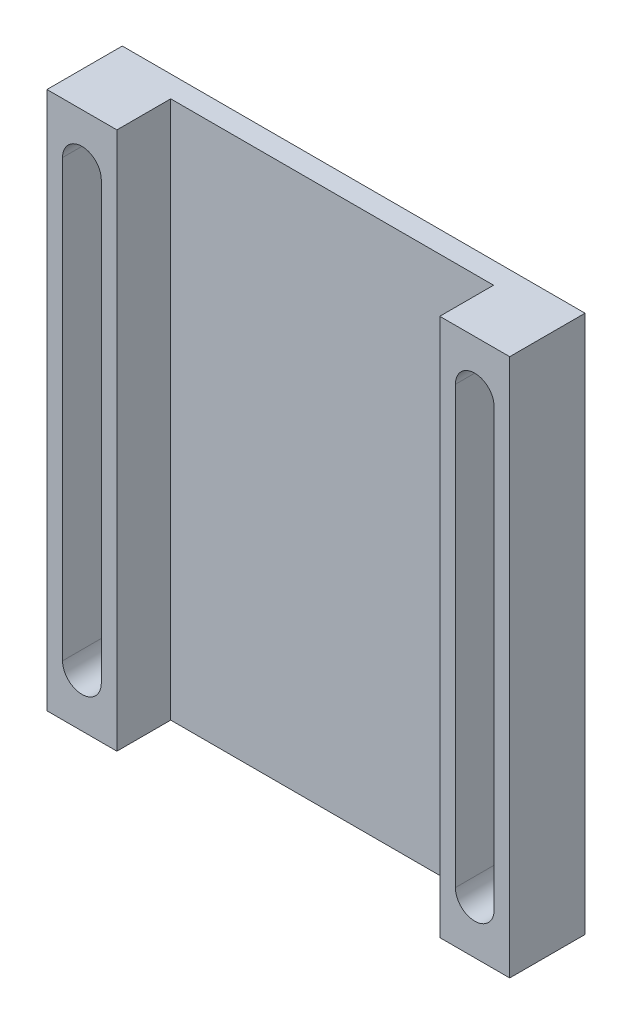
ISO-10303-21;
HEADER;
FILE_DESCRIPTION(('STEP AP214'),'2;1');
FILE_NAME('part.step','',(''),(''),'','','');
FILE_SCHEMA(('AUTOMOTIVE_DESIGN { 1 0 10303 214 1 1 1 1 }'));
ENDSEC;
DATA;
#1=APPLICATION_CONTEXT('core data for automotive mechanical design processes');
#2=APPLICATION_PROTOCOL_DEFINITION('international standard','automotive_design',2000,#1);
#3=PRODUCT_CONTEXT('',#1,'mechanical');
#4=PRODUCT('Part','Part','',(#3));
#5=PRODUCT_RELATED_PRODUCT_CATEGORY('part','',(#4));
#6=PRODUCT_DEFINITION_FORMATION('','',#4);
#7=PRODUCT_DEFINITION_CONTEXT('part definition',#1,'design');
#8=PRODUCT_DEFINITION('design','',#6,#7);
#9=PRODUCT_DEFINITION_SHAPE('','',#8);
#10=(LENGTH_UNIT() NAMED_UNIT(*) SI_UNIT(.MILLI.,.METRE.));
#11=(NAMED_UNIT(*) PLANE_ANGLE_UNIT() SI_UNIT($,.RADIAN.));
#12=(NAMED_UNIT(*) SI_UNIT($,.STERADIAN.) SOLID_ANGLE_UNIT());
#13=UNCERTAINTY_MEASURE_WITH_UNIT(LENGTH_MEASURE(1.E-05),#10,'distance_accuracy_value','');
#14=(GEOMETRIC_REPRESENTATION_CONTEXT(3) GLOBAL_UNCERTAINTY_ASSIGNED_CONTEXT((#13)) GLOBAL_UNIT_ASSIGNED_CONTEXT((#10,
#11,#12)) REPRESENTATION_CONTEXT('',''));
#15=CARTESIAN_POINT('',(0.,0.,0.));
#16=DIRECTION('',(0.,0.,1.));
#17=DIRECTION('',(1.,0.,0.));
#18=AXIS2_PLACEMENT_3D('',#15,#16,#17);
#19=CARTESIAN_POINT('',(0.,0.,70.));
#20=DIRECTION('',(0.,0.,1.));
#21=DIRECTION('',(1.,0.,0.));
#22=AXIS2_PLACEMENT_3D('',#19,#20,#21);
#23=PLANE('',#22);
#24=DIRECTION('',(1.,0.,0.));
#25=VECTOR('',#24,1.);
#26=CARTESIAN_POINT('',(0.,250.,70.));
#27=LINE('',#26,#25);
#28=CARTESIAN_POINT('',(150.,250.,70.));
#29=VERTEX_POINT('',#28);
#30=CARTESIAN_POINT('',(215.,250.,70.));
#31=VERTEX_POINT('',#30);
#32=EDGE_CURVE('E271',#29,#31,#27,.T.);
#33=ORIENTED_EDGE('',*,*,#32,.F.);
#34=DIRECTION('',(0.,-1.,0.));
#35=VECTOR('',#34,1.);
#36=CARTESIAN_POINT('',(150.,0.,70.));
#37=LINE('',#36,#35);
#38=CARTESIAN_POINT('',(150.,-250.,70.));
#39=VERTEX_POINT('',#38);
#40=EDGE_CURVE('E274',#29,#39,#37,.T.);
#41=ORIENTED_EDGE('',*,*,#40,.T.);
#42=DIRECTION('',(1.,0.,0.));
#43=VECTOR('',#42,1.);
#44=CARTESIAN_POINT('',(0.,-250.,70.));
#45=LINE('',#44,#43);
#46=CARTESIAN_POINT('',(215.,-250.,70.));
#47=VERTEX_POINT('',#46);
#48=EDGE_CURVE('E276',#39,#47,#45,.T.);
#49=ORIENTED_EDGE('',*,*,#48,.T.);
#50=DIRECTION('',(0.,-1.,0.));
#51=VECTOR('',#50,1.);
#52=CARTESIAN_POINT('',(215.,0.,70.));
#53=LINE('',#52,#51);
#54=EDGE_CURVE('E278',#31,#47,#53,.T.);
#55=ORIENTED_EDGE('',*,*,#54,.F.);
#56=EDGE_LOOP('',(#33,#41,#49,#55));
#57=FACE_BOUND('',#56,.T.);
#58=CARTESIAN_POINT('',(182.5,-202.5,70.));
#59=DIRECTION('',(0.,0.,1.));
#60=DIRECTION('',(1.,0.,0.));
#61=AXIS2_PLACEMENT_3D('',#58,#59,#60);
#62=CIRCLE('',#61,18.);
#63=CARTESIAN_POINT('',(164.5,-202.5,70.));
#64=VERTEX_POINT('',#63);
#65=CARTESIAN_POINT('',(200.5,-202.5,70.));
#66=VERTEX_POINT('',#65);
#67=EDGE_CURVE('E226',#64,#66,#62,.T.);
#68=ORIENTED_EDGE('',*,*,#67,.F.);
#69=DIRECTION('',(0.,1.,0.));
#70=VECTOR('',#69,1.);
#71=CARTESIAN_POINT('',(164.5,0.,70.));
#72=LINE('',#71,#70);
#73=CARTESIAN_POINT('',(164.5,202.5,70.));
#74=VERTEX_POINT('',#73);
#75=EDGE_CURVE('E81',#64,#74,#72,.T.);
#76=ORIENTED_EDGE('',*,*,#75,.T.);
#77=CARTESIAN_POINT('',(182.5,202.5,70.));
#78=DIRECTION('',(0.,0.,1.));
#79=DIRECTION('',(1.,0.,0.));
#80=AXIS2_PLACEMENT_3D('',#77,#78,#79);
#81=CIRCLE('',#80,18.);
#82=CARTESIAN_POINT('',(200.5,202.5,70.));
#83=VERTEX_POINT('',#82);
#84=EDGE_CURVE('E233',#83,#74,#81,.T.);
#85=ORIENTED_EDGE('',*,*,#84,.F.);
#86=DIRECTION('',(0.,1.,0.));
#87=VECTOR('',#86,1.);
#88=CARTESIAN_POINT('',(200.5,0.,70.));
#89=LINE('',#88,#87);
#90=EDGE_CURVE('E229',#66,#83,#89,.T.);
#91=ORIENTED_EDGE('',*,*,#90,.F.);
#92=EDGE_LOOP('',(#68,#76,#85,#91));
#93=FACE_BOUND('',#92,.T.);
#94=ADVANCED_FACE('F64',(#57,#93),#23,.T.);
#95=CARTESIAN_POINT('',(0.,250.,20.));
#96=DIRECTION('',(0.,1.,0.));
#97=DIRECTION('',(0.,0.,1.));
#98=AXIS2_PLACEMENT_3D('',#95,#96,#97);
#99=PLANE('',#98);
#100=DIRECTION('',(1.,0.,0.));
#101=VECTOR('',#100,1.);
#102=CARTESIAN_POINT('',(0.,250.,0.));
#103=LINE('',#102,#101);
#104=CARTESIAN_POINT('',(-215.,250.,0.));
#105=VERTEX_POINT('',#104);
#106=CARTESIAN_POINT('',(215.,250.,0.));
#107=VERTEX_POINT('',#106);
#108=EDGE_CURVE('E295',#105,#107,#103,.T.);
#109=ORIENTED_EDGE('',*,*,#108,.F.);
#110=DIRECTION('',(0.,0.,-1.));
#111=VECTOR('',#110,1.);
#112=CARTESIAN_POINT('',(-215.,250.,70.));
#113=LINE('',#112,#111);
#114=CARTESIAN_POINT('',(-215.,250.,70.));
#115=VERTEX_POINT('',#114);
#116=EDGE_CURVE('E213',#115,#105,#113,.T.);
#117=ORIENTED_EDGE('',*,*,#116,.F.);
#118=DIRECTION('',(1.,0.,0.));
#119=VECTOR('',#118,1.);
#120=CARTESIAN_POINT('',(0.,250.,70.));
#121=LINE('',#120,#119);
#122=CARTESIAN_POINT('',(-150.,250.,70.));
#123=VERTEX_POINT('',#122);
#124=EDGE_CURVE('E261',#115,#123,#121,.T.);
#125=ORIENTED_EDGE('',*,*,#124,.T.);
#126=DIRECTION('',(0.,0.,-1.));
#127=VECTOR('',#126,1.);
#128=CARTESIAN_POINT('',(-150.,250.,70.));
#129=LINE('',#128,#127);
#130=CARTESIAN_POINT('',(-150.,250.,20.));
#131=VERTEX_POINT('',#130);
#132=EDGE_CURVE('E253',#123,#131,#129,.T.);
#133=ORIENTED_EDGE('',*,*,#132,.T.);
#134=DIRECTION('',(1.,0.,0.));
#135=VECTOR('',#134,1.);
#136=CARTESIAN_POINT('',(0.,250.,20.));
#137=LINE('',#136,#135);
#138=CARTESIAN_POINT('',(150.,250.,20.));
#139=VERTEX_POINT('',#138);
#140=EDGE_CURVE('E296',#131,#139,#137,.T.);
#141=ORIENTED_EDGE('',*,*,#140,.T.);
#142=DIRECTION('',(0.,0.,-1.));
#143=VECTOR('',#142,1.);
#144=CARTESIAN_POINT('',(150.,250.,70.));
#145=LINE('',#144,#143);
#146=EDGE_CURVE('E292',#29,#139,#145,.T.);
#147=ORIENTED_EDGE('',*,*,#146,.F.);
#148=ORIENTED_EDGE('',*,*,#32,.T.);
#149=DIRECTION('',(0.,0.,-1.));
#150=VECTOR('',#149,1.);
#151=CARTESIAN_POINT('',(215.,250.,70.));
#152=LINE('',#151,#150);
#153=EDGE_CURVE('E281',#31,#107,#152,.T.);
#154=ORIENTED_EDGE('',*,*,#153,.T.);
#155=EDGE_LOOP('',(#109,#117,#125,#133,#141,#147,#148,#154));
#156=FACE_BOUND('',#155,.T.);
#157=ADVANCED_FACE('F66',(#156),#99,.T.);
#158=CARTESIAN_POINT('',(0.,-250.,20.));
#159=DIRECTION('',(0.,1.,0.));
#160=DIRECTION('',(0.,0.,1.));
#161=AXIS2_PLACEMENT_3D('',#158,#159,#160);
#162=PLANE('',#161);
#163=DIRECTION('',(1.,0.,0.));
#164=VECTOR('',#163,1.);
#165=CARTESIAN_POINT('',(0.,-250.,0.));
#166=LINE('',#165,#164);
#167=CARTESIAN_POINT('',(-215.,-250.,0.));
#168=VERTEX_POINT('',#167);
#169=CARTESIAN_POINT('',(215.,-250.,0.));
#170=VERTEX_POINT('',#169);
#171=EDGE_CURVE('E68',#168,#170,#166,.T.);
#172=ORIENTED_EDGE('',*,*,#171,.T.);
#173=DIRECTION('',(0.,0.,-1.));
#174=VECTOR('',#173,1.);
#175=CARTESIAN_POINT('',(215.,-250.,70.));
#176=LINE('',#175,#174);
#177=EDGE_CURVE('E286',#47,#170,#176,.T.);
#178=ORIENTED_EDGE('',*,*,#177,.F.);
#179=ORIENTED_EDGE('',*,*,#48,.F.);
#180=DIRECTION('',(0.,0.,-1.));
#181=VECTOR('',#180,1.);
#182=CARTESIAN_POINT('',(150.,-250.,70.));
#183=LINE('',#182,#181);
#184=CARTESIAN_POINT('',(150.,-250.,20.));
#185=VERTEX_POINT('',#184);
#186=EDGE_CURVE('E289',#39,#185,#183,.T.);
#187=ORIENTED_EDGE('',*,*,#186,.T.);
#188=DIRECTION('',(1.,0.,0.));
#189=VECTOR('',#188,1.);
#190=CARTESIAN_POINT('',(0.,-250.,20.));
#191=LINE('',#190,#189);
#192=CARTESIAN_POINT('',(-150.,-250.,20.));
#193=VERTEX_POINT('',#192);
#194=EDGE_CURVE('E73',#193,#185,#191,.T.);
#195=ORIENTED_EDGE('',*,*,#194,.F.);
#196=DIRECTION('',(0.,0.,-1.));
#197=VECTOR('',#196,1.);
#198=CARTESIAN_POINT('',(-150.,-250.,70.));
#199=LINE('',#198,#197);
#200=CARTESIAN_POINT('',(-150.,-250.,70.));
#201=VERTEX_POINT('',#200);
#202=EDGE_CURVE('E251',#201,#193,#199,.T.);
#203=ORIENTED_EDGE('',*,*,#202,.F.);
#204=DIRECTION('',(1.,0.,0.));
#205=VECTOR('',#204,1.);
#206=CARTESIAN_POINT('',(0.,-250.,70.));
#207=LINE('',#206,#205);
#208=CARTESIAN_POINT('',(-215.,-250.,70.));
#209=VERTEX_POINT('',#208);
#210=EDGE_CURVE('E264',#209,#201,#207,.T.);
#211=ORIENTED_EDGE('',*,*,#210,.F.);
#212=DIRECTION('',(0.,0.,-1.));
#213=VECTOR('',#212,1.);
#214=CARTESIAN_POINT('',(-215.,-250.,70.));
#215=LINE('',#214,#213);
#216=EDGE_CURVE('E248',#209,#168,#215,.T.);
#217=ORIENTED_EDGE('',*,*,#216,.T.);
#218=EDGE_LOOP('',(#172,#178,#179,#187,#195,#203,#211,#217));
#219=FACE_BOUND('',#218,.T.);
#220=ADVANCED_FACE('F305',(#219),#162,.F.);
#221=CARTESIAN_POINT('',(0.,0.,20.));
#222=DIRECTION('',(0.,0.,1.));
#223=DIRECTION('',(1.,0.,0.));
#224=AXIS2_PLACEMENT_3D('',#221,#222,#223);
#225=PLANE('',#224);
#226=ORIENTED_EDGE('',*,*,#140,.F.);
#227=DIRECTION('',(0.,-1.,0.));
#228=VECTOR('',#227,1.);
#229=CARTESIAN_POINT('',(-150.,0.,20.));
#230=LINE('',#229,#228);
#231=EDGE_CURVE('E298',#131,#193,#230,.T.);
#232=ORIENTED_EDGE('',*,*,#231,.T.);
#233=ORIENTED_EDGE('',*,*,#194,.T.);
#234=DIRECTION('',(0.,-1.,0.));
#235=VECTOR('',#234,1.);
#236=CARTESIAN_POINT('',(150.,0.,20.));
#237=LINE('',#236,#235);
#238=EDGE_CURVE('E12',#139,#185,#237,.T.);
#239=ORIENTED_EDGE('',*,*,#238,.F.);
#240=EDGE_LOOP('',(#226,#232,#233,#239));
#241=FACE_BOUND('',#240,.T.);
#242=ADVANCED_FACE('F315',(#241),#225,.T.);
#243=CARTESIAN_POINT('',(0.,0.,0.));
#244=DIRECTION('',(0.,0.,1.));
#245=DIRECTION('',(1.,0.,0.));
#246=AXIS2_PLACEMENT_3D('',#243,#244,#245);
#247=PLANE('',#246);
#248=ORIENTED_EDGE('',*,*,#108,.T.);
#249=DIRECTION('',(0.,-1.,0.));
#250=VECTOR('',#249,1.);
#251=CARTESIAN_POINT('',(215.,0.,0.));
#252=LINE('',#251,#250);
#253=EDGE_CURVE('E260',#107,#170,#252,.T.);
#254=ORIENTED_EDGE('',*,*,#253,.T.);
#255=ORIENTED_EDGE('',*,*,#171,.F.);
#256=DIRECTION('',(0.,-1.,0.));
#257=VECTOR('',#256,1.);
#258=CARTESIAN_POINT('',(-215.,0.,0.));
#259=LINE('',#258,#257);
#260=EDGE_CURVE('E257',#105,#168,#259,.T.);
#261=ORIENTED_EDGE('',*,*,#260,.F.);
#262=EDGE_LOOP('',(#248,#254,#255,#261));
#263=FACE_BOUND('',#262,.T.);
#264=ADVANCED_FACE('F312',(#263),#247,.F.);
#265=CARTESIAN_POINT('',(150.,0.,70.));
#266=DIRECTION('',(1.,0.,0.));
#267=DIRECTION('',(0.,0.,-1.));
#268=AXIS2_PLACEMENT_3D('',#265,#266,#267);
#269=PLANE('',#268);
#270=ORIENTED_EDGE('',*,*,#146,.T.);
#271=ORIENTED_EDGE('',*,*,#238,.T.);
#272=ORIENTED_EDGE('',*,*,#186,.F.);
#273=ORIENTED_EDGE('',*,*,#40,.F.);
#274=EDGE_LOOP('',(#270,#271,#272,#273));
#275=FACE_BOUND('',#274,.T.);
#276=ADVANCED_FACE('F314',(#275),#269,.F.);
#277=CARTESIAN_POINT('',(215.,0.,70.));
#278=DIRECTION('',(1.,0.,0.));
#279=DIRECTION('',(0.,0.,-1.));
#280=AXIS2_PLACEMENT_3D('',#277,#278,#279);
#281=PLANE('',#280);
#282=ORIENTED_EDGE('',*,*,#253,.F.);
#283=ORIENTED_EDGE('',*,*,#153,.F.);
#284=ORIENTED_EDGE('',*,*,#54,.T.);
#285=ORIENTED_EDGE('',*,*,#177,.T.);
#286=EDGE_LOOP('',(#282,#283,#284,#285));
#287=FACE_BOUND('',#286,.T.);
#288=ADVANCED_FACE('F310',(#287),#281,.T.);
#289=CARTESIAN_POINT('',(-150.,0.,70.));
#290=DIRECTION('',(1.,0.,0.));
#291=DIRECTION('',(0.,0.,-1.));
#292=AXIS2_PLACEMENT_3D('',#289,#290,#291);
#293=PLANE('',#292);
#294=ORIENTED_EDGE('',*,*,#231,.F.);
#295=ORIENTED_EDGE('',*,*,#132,.F.);
#296=DIRECTION('',(0.,-1.,0.));
#297=VECTOR('',#296,1.);
#298=CARTESIAN_POINT('',(-150.,0.,70.));
#299=LINE('',#298,#297);
#300=EDGE_CURVE('E256',#123,#201,#299,.T.);
#301=ORIENTED_EDGE('',*,*,#300,.T.);
#302=ORIENTED_EDGE('',*,*,#202,.T.);
#303=EDGE_LOOP('',(#294,#295,#301,#302));
#304=FACE_BOUND('',#303,.T.);
#305=ADVANCED_FACE('F339',(#304),#293,.T.);
#306=CARTESIAN_POINT('',(-215.,0.,70.));
#307=DIRECTION('',(1.,0.,0.));
#308=DIRECTION('',(0.,0.,-1.));
#309=AXIS2_PLACEMENT_3D('',#306,#307,#308);
#310=PLANE('',#309);
#311=ORIENTED_EDGE('',*,*,#260,.T.);
#312=ORIENTED_EDGE('',*,*,#216,.F.);
#313=DIRECTION('',(0.,-1.,0.));
#314=VECTOR('',#313,1.);
#315=CARTESIAN_POINT('',(-215.,0.,70.));
#316=LINE('',#315,#314);
#317=EDGE_CURVE('E266',#115,#209,#316,.T.);
#318=ORIENTED_EDGE('',*,*,#317,.F.);
#319=ORIENTED_EDGE('',*,*,#116,.T.);
#320=EDGE_LOOP('',(#311,#312,#318,#319));
#321=FACE_BOUND('',#320,.T.);
#322=ADVANCED_FACE('F343',(#321),#310,.F.);
#323=CARTESIAN_POINT('',(0.,0.,70.));
#324=DIRECTION('',(0.,0.,1.));
#325=DIRECTION('',(1.,0.,0.));
#326=AXIS2_PLACEMENT_3D('',#323,#324,#325);
#327=PLANE('',#326);
#328=CARTESIAN_POINT('',(-182.5,-202.5,70.));
#329=DIRECTION('',(0.,0.,1.));
#330=DIRECTION('',(1.,0.,0.));
#331=AXIS2_PLACEMENT_3D('',#328,#329,#330);
#332=CIRCLE('',#331,18.);
#333=CARTESIAN_POINT('',(-200.5,-202.5,70.));
#334=VERTEX_POINT('',#333);
#335=CARTESIAN_POINT('',(-164.5,-202.5,70.));
#336=VERTEX_POINT('',#335);
#337=EDGE_CURVE('E89',#334,#336,#332,.T.);
#338=ORIENTED_EDGE('',*,*,#337,.F.);
#339=DIRECTION('',(0.,1.,0.));
#340=VECTOR('',#339,1.);
#341=CARTESIAN_POINT('',(-200.5,0.,70.));
#342=LINE('',#341,#340);
#343=CARTESIAN_POINT('',(-200.5,202.5,70.));
#344=VERTEX_POINT('',#343);
#345=EDGE_CURVE('E198',#334,#344,#342,.T.);
#346=ORIENTED_EDGE('',*,*,#345,.T.);
#347=CARTESIAN_POINT('',(-182.5,202.5,70.));
#348=DIRECTION('',(0.,0.,1.));
#349=DIRECTION('',(1.,0.,0.));
#350=AXIS2_PLACEMENT_3D('',#347,#348,#349);
#351=CIRCLE('',#350,18.);
#352=CARTESIAN_POINT('',(-164.5,202.5,70.));
#353=VERTEX_POINT('',#352);
#354=EDGE_CURVE('E201',#353,#344,#351,.T.);
#355=ORIENTED_EDGE('',*,*,#354,.F.);
#356=DIRECTION('',(0.,1.,0.));
#357=VECTOR('',#356,1.);
#358=CARTESIAN_POINT('',(-164.5,0.,70.));
#359=LINE('',#358,#357);
#360=EDGE_CURVE('E207',#336,#353,#359,.T.);
#361=ORIENTED_EDGE('',*,*,#360,.F.);
#362=EDGE_LOOP('',(#338,#346,#355,#361));
#363=FACE_BOUND('',#362,.T.);
#364=ORIENTED_EDGE('',*,*,#124,.F.);
#365=ORIENTED_EDGE('',*,*,#317,.T.);
#366=ORIENTED_EDGE('',*,*,#210,.T.);
#367=ORIENTED_EDGE('',*,*,#300,.F.);
#368=EDGE_LOOP('',(#364,#365,#366,#367));
#369=FACE_BOUND('',#368,.T.);
#370=ADVANCED_FACE('F336',(#363,#369),#327,.T.);
#371=CARTESIAN_POINT('',(-182.5,-202.5,23.));
#372=DIRECTION('',(0.,0.,1.));
#373=DIRECTION('',(1.,0.,0.));
#374=AXIS2_PLACEMENT_3D('',#371,#372,#373);
#375=CYLINDRICAL_SURFACE('',#374,18.);
#376=ORIENTED_EDGE('',*,*,#337,.T.);
#377=DIRECTION('',(0.,0.,1.));
#378=VECTOR('',#377,1.);
#379=CARTESIAN_POINT('',(-164.5,-202.5,23.));
#380=LINE('',#379,#378);
#381=CARTESIAN_POINT('',(-164.5,-202.5,23.));
#382=VERTEX_POINT('',#381);
#383=EDGE_CURVE('E177',#382,#336,#380,.T.);
#384=ORIENTED_EDGE('',*,*,#383,.F.);
#385=CARTESIAN_POINT('',(-182.5,-202.5,23.));
#386=DIRECTION('',(0.,0.,1.));
#387=DIRECTION('',(1.,0.,0.));
#388=AXIS2_PLACEMENT_3D('',#385,#386,#387);
#389=CIRCLE('',#388,18.);
#390=CARTESIAN_POINT('',(-200.5,-202.5,23.));
#391=VERTEX_POINT('',#390);
#392=EDGE_CURVE('E181',#391,#382,#389,.T.);
#393=ORIENTED_EDGE('',*,*,#392,.F.);
#394=DIRECTION('',(0.,0.,1.));
#395=VECTOR('',#394,1.);
#396=CARTESIAN_POINT('',(-200.5,-202.5,23.));
#397=LINE('',#396,#395);
#398=EDGE_CURVE('E211',#391,#334,#397,.T.);
#399=ORIENTED_EDGE('',*,*,#398,.T.);
#400=EDGE_LOOP('',(#376,#384,#393,#399));
#401=FACE_BOUND('',#400,.T.);
#402=ADVANCED_FACE('F179',(#401),#375,.F.);
#403=CARTESIAN_POINT('',(-200.5,0.,23.));
#404=DIRECTION('',(1.,0.,0.));
#405=DIRECTION('',(0.,0.,-1.));
#406=AXIS2_PLACEMENT_3D('',#403,#404,#405);
#407=PLANE('',#406);
#408=ORIENTED_EDGE('',*,*,#345,.F.);
#409=ORIENTED_EDGE('',*,*,#398,.F.);
#410=DIRECTION('',(0.,1.,0.));
#411=VECTOR('',#410,1.);
#412=CARTESIAN_POINT('',(-200.5,0.,23.));
#413=LINE('',#412,#411);
#414=CARTESIAN_POINT('',(-200.5,202.5,23.));
#415=VERTEX_POINT('',#414);
#416=EDGE_CURVE('E186',#391,#415,#413,.T.);
#417=ORIENTED_EDGE('',*,*,#416,.T.);
#418=DIRECTION('',(0.,0.,1.));
#419=VECTOR('',#418,1.);
#420=CARTESIAN_POINT('',(-200.5,202.5,23.));
#421=LINE('',#420,#419);
#422=EDGE_CURVE('E214',#415,#344,#421,.T.);
#423=ORIENTED_EDGE('',*,*,#422,.T.);
#424=EDGE_LOOP('',(#408,#409,#417,#423));
#425=FACE_BOUND('',#424,.T.);
#426=ADVANCED_FACE('F372',(#425),#407,.T.);
#427=CARTESIAN_POINT('',(-182.5,202.5,23.));
#428=DIRECTION('',(0.,0.,1.));
#429=DIRECTION('',(1.,0.,0.));
#430=AXIS2_PLACEMENT_3D('',#427,#428,#429);
#431=CYLINDRICAL_SURFACE('',#430,18.);
#432=ORIENTED_EDGE('',*,*,#354,.T.);
#433=ORIENTED_EDGE('',*,*,#422,.F.);
#434=CARTESIAN_POINT('',(-182.5,202.5,23.));
#435=DIRECTION('',(0.,0.,1.));
#436=DIRECTION('',(1.,0.,0.));
#437=AXIS2_PLACEMENT_3D('',#434,#435,#436);
#438=CIRCLE('',#437,18.);
#439=CARTESIAN_POINT('',(-164.5,202.5,23.));
#440=VERTEX_POINT('',#439);
#441=EDGE_CURVE('E194',#440,#415,#438,.T.);
#442=ORIENTED_EDGE('',*,*,#441,.F.);
#443=DIRECTION('',(0.,0.,1.));
#444=VECTOR('',#443,1.);
#445=CARTESIAN_POINT('',(-164.5,202.5,23.));
#446=LINE('',#445,#444);
#447=EDGE_CURVE('E185',#440,#353,#446,.T.);
#448=ORIENTED_EDGE('',*,*,#447,.T.);
#449=EDGE_LOOP('',(#432,#433,#442,#448));
#450=FACE_BOUND('',#449,.T.);
#451=ADVANCED_FACE('F375',(#450),#431,.F.);
#452=CARTESIAN_POINT('',(-164.5,0.,23.));
#453=DIRECTION('',(1.,0.,0.));
#454=DIRECTION('',(0.,0.,-1.));
#455=AXIS2_PLACEMENT_3D('',#452,#453,#454);
#456=PLANE('',#455);
#457=ORIENTED_EDGE('',*,*,#360,.T.);
#458=ORIENTED_EDGE('',*,*,#447,.F.);
#459=DIRECTION('',(0.,1.,0.));
#460=VECTOR('',#459,1.);
#461=CARTESIAN_POINT('',(-164.5,0.,23.));
#462=LINE('',#461,#460);
#463=EDGE_CURVE('E189',#382,#440,#462,.T.);
#464=ORIENTED_EDGE('',*,*,#463,.F.);
#465=ORIENTED_EDGE('',*,*,#383,.T.);
#466=EDGE_LOOP('',(#457,#458,#464,#465));
#467=FACE_BOUND('',#466,.T.);
#468=ADVANCED_FACE('F190',(#467),#456,.F.);
#469=CARTESIAN_POINT('',(-182.5,-202.5,23.));
#470=DIRECTION('',(0.,0.,1.));
#471=DIRECTION('',(1.,0.,0.));
#472=AXIS2_PLACEMENT_3D('',#469,#470,#471);
#473=PLANE('',#472);
#474=ORIENTED_EDGE('',*,*,#392,.T.);
#475=ORIENTED_EDGE('',*,*,#463,.T.);
#476=ORIENTED_EDGE('',*,*,#441,.T.);
#477=ORIENTED_EDGE('',*,*,#416,.F.);
#478=EDGE_LOOP('',(#474,#475,#476,#477));
#479=FACE_BOUND('',#478,.T.);
#480=ADVANCED_FACE('F197',(#479),#473,.T.);
#481=CARTESIAN_POINT('',(164.5,0.,23.));
#482=DIRECTION('',(1.,0.,0.));
#483=DIRECTION('',(0.,0.,-1.));
#484=AXIS2_PLACEMENT_3D('',#481,#482,#483);
#485=PLANE('',#484);
#486=ORIENTED_EDGE('',*,*,#75,.F.);
#487=DIRECTION('',(0.,0.,1.));
#488=VECTOR('',#487,1.);
#489=CARTESIAN_POINT('',(164.5,-202.5,23.));
#490=LINE('',#489,#488);
#491=CARTESIAN_POINT('',(164.5,-202.5,23.));
#492=VERTEX_POINT('',#491);
#493=EDGE_CURVE('E223',#492,#64,#490,.T.);
#494=ORIENTED_EDGE('',*,*,#493,.F.);
#495=DIRECTION('',(0.,1.,0.));
#496=VECTOR('',#495,1.);
#497=CARTESIAN_POINT('',(164.5,0.,23.));
#498=LINE('',#497,#496);
#499=CARTESIAN_POINT('',(164.5,202.5,23.));
#500=VERTEX_POINT('',#499);
#501=EDGE_CURVE('E230',#492,#500,#498,.T.);
#502=ORIENTED_EDGE('',*,*,#501,.T.);
#503=DIRECTION('',(0.,0.,1.));
#504=VECTOR('',#503,1.);
#505=CARTESIAN_POINT('',(164.5,202.5,23.));
#506=LINE('',#505,#504);
#507=EDGE_CURVE('E217',#500,#74,#506,.T.);
#508=ORIENTED_EDGE('',*,*,#507,.T.);
#509=EDGE_LOOP('',(#486,#494,#502,#508));
#510=FACE_BOUND('',#509,.T.);
#511=ADVANCED_FACE('F366',(#510),#485,.T.);
#512=CARTESIAN_POINT('',(182.5,202.5,23.));
#513=DIRECTION('',(0.,0.,1.));
#514=DIRECTION('',(1.,0.,0.));
#515=AXIS2_PLACEMENT_3D('',#512,#513,#514);
#516=CYLINDRICAL_SURFACE('',#515,18.);
#517=ORIENTED_EDGE('',*,*,#84,.T.);
#518=ORIENTED_EDGE('',*,*,#507,.F.);
#519=CARTESIAN_POINT('',(182.5,202.5,23.));
#520=DIRECTION('',(0.,0.,1.));
#521=DIRECTION('',(1.,0.,0.));
#522=AXIS2_PLACEMENT_3D('',#519,#520,#521);
#523=CIRCLE('',#522,18.);
#524=CARTESIAN_POINT('',(200.5,202.5,23.));
#525=VERTEX_POINT('',#524);
#526=EDGE_CURVE('E242',#525,#500,#523,.T.);
#527=ORIENTED_EDGE('',*,*,#526,.F.);
#528=DIRECTION('',(0.,0.,1.));
#529=VECTOR('',#528,1.);
#530=CARTESIAN_POINT('',(200.5,202.5,23.));
#531=LINE('',#530,#529);
#532=EDGE_CURVE('E219',#525,#83,#531,.T.);
#533=ORIENTED_EDGE('',*,*,#532,.T.);
#534=EDGE_LOOP('',(#517,#518,#527,#533));
#535=FACE_BOUND('',#534,.T.);
#536=ADVANCED_FACE('F362',(#535),#516,.F.);
#537=CARTESIAN_POINT('',(200.5,0.,23.));
#538=DIRECTION('',(1.,0.,0.));
#539=DIRECTION('',(0.,0.,-1.));
#540=AXIS2_PLACEMENT_3D('',#537,#538,#539);
#541=PLANE('',#540);
#542=ORIENTED_EDGE('',*,*,#90,.T.);
#543=ORIENTED_EDGE('',*,*,#532,.F.);
#544=DIRECTION('',(0.,1.,0.));
#545=VECTOR('',#544,1.);
#546=CARTESIAN_POINT('',(200.5,0.,23.));
#547=LINE('',#546,#545);
#548=CARTESIAN_POINT('',(200.5,-202.5,23.));
#549=VERTEX_POINT('',#548);
#550=EDGE_CURVE('E239',#549,#525,#547,.T.);
#551=ORIENTED_EDGE('',*,*,#550,.F.);
#552=DIRECTION('',(0.,0.,1.));
#553=VECTOR('',#552,1.);
#554=CARTESIAN_POINT('',(200.5,-202.5,23.));
#555=LINE('',#554,#553);
#556=EDGE_CURVE('E221',#549,#66,#555,.T.);
#557=ORIENTED_EDGE('',*,*,#556,.T.);
#558=EDGE_LOOP('',(#542,#543,#551,#557));
#559=FACE_BOUND('',#558,.T.);
#560=ADVANCED_FACE('F358',(#559),#541,.F.);
#561=CARTESIAN_POINT('',(182.5,-202.5,23.));
#562=DIRECTION('',(0.,0.,1.));
#563=DIRECTION('',(1.,0.,0.));
#564=AXIS2_PLACEMENT_3D('',#561,#562,#563);
#565=CYLINDRICAL_SURFACE('',#564,18.);
#566=ORIENTED_EDGE('',*,*,#67,.T.);
#567=ORIENTED_EDGE('',*,*,#556,.F.);
#568=CARTESIAN_POINT('',(182.5,-202.5,23.));
#569=DIRECTION('',(0.,0.,1.));
#570=DIRECTION('',(1.,0.,0.));
#571=AXIS2_PLACEMENT_3D('',#568,#569,#570);
#572=CIRCLE('',#571,18.);
#573=EDGE_CURVE('E225',#492,#549,#572,.T.);
#574=ORIENTED_EDGE('',*,*,#573,.F.);
#575=ORIENTED_EDGE('',*,*,#493,.T.);
#576=EDGE_LOOP('',(#566,#567,#574,#575));
#577=FACE_BOUND('',#576,.T.);
#578=ADVANCED_FACE('F354',(#577),#565,.F.);
#579=CARTESIAN_POINT('',(182.5,202.5,23.));
#580=DIRECTION('',(0.,0.,1.));
#581=DIRECTION('',(1.,0.,0.));
#582=AXIS2_PLACEMENT_3D('',#579,#580,#581);
#583=PLANE('',#582);
#584=ORIENTED_EDGE('',*,*,#501,.F.);
#585=ORIENTED_EDGE('',*,*,#573,.T.);
#586=ORIENTED_EDGE('',*,*,#550,.T.);
#587=ORIENTED_EDGE('',*,*,#526,.T.);
#588=EDGE_LOOP('',(#584,#585,#586,#587));
#589=FACE_BOUND('',#588,.T.);
#590=ADVANCED_FACE('F351',(#589),#583,.T.);
#591=CLOSED_SHELL('',(#94,#157,#220,#242,#264,#276,#288,#305,#322,#370,#402,#426,#451,#468,#480,
#511,#536,#560,#578,#590));
#592=MANIFOLD_SOLID_BREP('B2',#591);
#593=ADVANCED_BREP_SHAPE_REPRESENTATION('',(#18,#592),#14);
#594=SHAPE_DEFINITION_REPRESENTATION(#9,#593);
ENDSEC;
END-ISO-10303-21;
